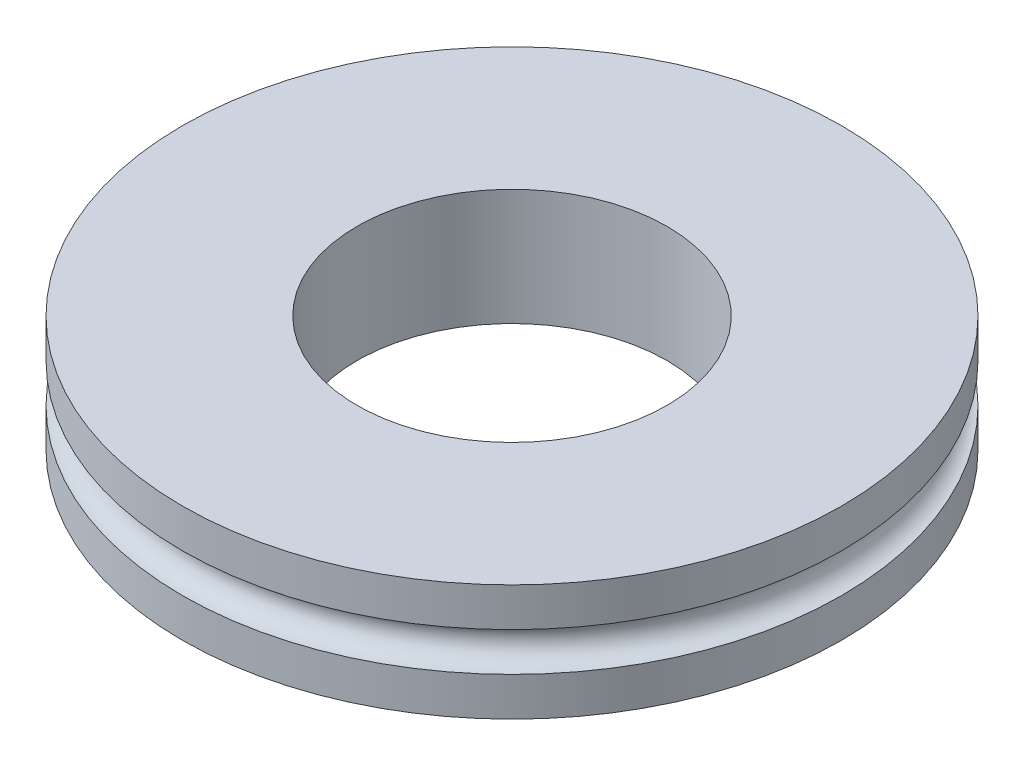
ISO-10303-21;
HEADER;
FILE_DESCRIPTION(('STEP AP214'),'2;1');
FILE_NAME('part.step','',(''),(''),'','','');
FILE_SCHEMA(('AUTOMOTIVE_DESIGN { 1 0 10303 214 1 1 1 1 }'));
ENDSEC;
DATA;
#1=APPLICATION_CONTEXT('core data for automotive mechanical design processes');
#2=APPLICATION_PROTOCOL_DEFINITION('international standard','automotive_design',2000,#1);
#3=PRODUCT_CONTEXT('',#1,'mechanical');
#4=PRODUCT('Part','Part','',(#3));
#5=PRODUCT_RELATED_PRODUCT_CATEGORY('part','',(#4));
#6=PRODUCT_DEFINITION_FORMATION('','',#4);
#7=PRODUCT_DEFINITION_CONTEXT('part definition',#1,'design');
#8=PRODUCT_DEFINITION('design','',#6,#7);
#9=PRODUCT_DEFINITION_SHAPE('','',#8);
#10=(LENGTH_UNIT() NAMED_UNIT(*) SI_UNIT(.MILLI.,.METRE.));
#11=(NAMED_UNIT(*) PLANE_ANGLE_UNIT() SI_UNIT($,.RADIAN.));
#12=(NAMED_UNIT(*) SI_UNIT($,.STERADIAN.) SOLID_ANGLE_UNIT());
#13=UNCERTAINTY_MEASURE_WITH_UNIT(LENGTH_MEASURE(1.E-05),#10,'distance_accuracy_value','');
#14=(GEOMETRIC_REPRESENTATION_CONTEXT(3) GLOBAL_UNCERTAINTY_ASSIGNED_CONTEXT((#13)) GLOBAL_UNIT_ASSIGNED_CONTEXT((#10,
#11,#12)) REPRESENTATION_CONTEXT('',''));
#15=CARTESIAN_POINT('',(0.,0.,0.));
#16=DIRECTION('',(0.,0.,1.));
#17=DIRECTION('',(1.,0.,0.));
#18=AXIS2_PLACEMENT_3D('',#15,#16,#17);
#19=CARTESIAN_POINT('',(0.,-1.5,0.));
#20=DIRECTION('',(0.,-1.,0.));
#21=DIRECTION('',(0.,0.,-1.));
#22=AXIS2_PLACEMENT_3D('',#19,#20,#21);
#23=CYLINDRICAL_SURFACE('',#22,8.5);
#24=CARTESIAN_POINT('',(0.,1.5,0.));
#25=DIRECTION('',(0.,-1.,0.));
#26=DIRECTION('',(0.,0.,-1.));
#27=AXIS2_PLACEMENT_3D('',#24,#25,#26);
#28=CIRCLE('',#27,8.5);
#29=CARTESIAN_POINT('',(0.,1.5,-8.5));
#30=VERTEX_POINT('',#29);
#31=EDGE_CURVE('E10',#30,#30,#28,.T.);
#32=ORIENTED_EDGE('',*,*,#31,.T.);
#33=EDGE_LOOP('',(#32));
#34=FACE_BOUND('',#33,.T.);
#35=CARTESIAN_POINT('',(0.,0.5,0.));
#36=DIRECTION('',(0.,-1.,0.));
#37=DIRECTION('',(0.,0.,-1.));
#38=AXIS2_PLACEMENT_3D('',#35,#36,#37);
#39=CIRCLE('',#38,8.5);
#40=CARTESIAN_POINT('',(0.,0.5,-8.5));
#41=VERTEX_POINT('',#40);
#42=EDGE_CURVE('E70',#41,#41,#39,.T.);
#43=ORIENTED_EDGE('',*,*,#42,.F.);
#44=EDGE_LOOP('',(#43));
#45=FACE_BOUND('',#44,.T.);
#46=ADVANCED_FACE('F43',(#34,#45),#23,.T.);
#47=CARTESIAN_POINT('',(4.,1.5,0.));
#48=DIRECTION('',(0.,1.,0.));
#49=DIRECTION('',(0.,0.,1.));
#50=AXIS2_PLACEMENT_3D('',#47,#48,#49);
#51=PLANE('',#50);
#52=CARTESIAN_POINT('',(0.,1.5,0.));
#53=DIRECTION('',(0.,-1.,0.));
#54=DIRECTION('',(0.,0.,-1.));
#55=AXIS2_PLACEMENT_3D('',#52,#53,#54);
#56=CIRCLE('',#55,4.);
#57=CARTESIAN_POINT('',(0.,1.5,-4.));
#58=VERTEX_POINT('',#57);
#59=EDGE_CURVE('E50',#58,#58,#56,.T.);
#60=ORIENTED_EDGE('',*,*,#59,.T.);
#61=EDGE_LOOP('',(#60));
#62=FACE_BOUND('',#61,.T.);
#63=ORIENTED_EDGE('',*,*,#31,.F.);
#64=EDGE_LOOP('',(#63));
#65=FACE_BOUND('',#64,.T.);
#66=ADVANCED_FACE('F79',(#62,#65),#51,.T.);
#67=CARTESIAN_POINT('',(0.,-1.5,0.));
#68=DIRECTION('',(0.,-1.,0.));
#69=DIRECTION('',(0.,0.,-1.));
#70=AXIS2_PLACEMENT_3D('',#67,#68,#69);
#71=CYLINDRICAL_SURFACE('',#70,4.);
#72=CARTESIAN_POINT('',(0.,-1.5,0.));
#73=DIRECTION('',(0.,-1.,0.));
#74=DIRECTION('',(0.,0.,-1.));
#75=AXIS2_PLACEMENT_3D('',#72,#73,#74);
#76=CIRCLE('',#75,4.);
#77=CARTESIAN_POINT('',(0.,-1.5,-4.));
#78=VERTEX_POINT('',#77);
#79=EDGE_CURVE('E55',#78,#78,#76,.T.);
#80=ORIENTED_EDGE('',*,*,#79,.T.);
#81=EDGE_LOOP('',(#80));
#82=FACE_BOUND('',#81,.T.);
#83=ORIENTED_EDGE('',*,*,#59,.F.);
#84=EDGE_LOOP('',(#83));
#85=FACE_BOUND('',#84,.T.);
#86=ADVANCED_FACE('F83',(#82,#85),#71,.F.);
#87=CARTESIAN_POINT('',(8.5,-1.5,0.));
#88=DIRECTION('',(0.,-1.,0.));
#89=DIRECTION('',(0.,0.,-1.));
#90=AXIS2_PLACEMENT_3D('',#87,#88,#89);
#91=PLANE('',#90);
#92=CARTESIAN_POINT('',(0.,-1.5,0.));
#93=DIRECTION('',(0.,-1.,0.));
#94=DIRECTION('',(0.,0.,-1.));
#95=AXIS2_PLACEMENT_3D('',#92,#93,#94);
#96=CIRCLE('',#95,8.5);
#97=CARTESIAN_POINT('',(0.,-1.5,-8.5));
#98=VERTEX_POINT('',#97);
#99=EDGE_CURVE('E60',#98,#98,#96,.T.);
#100=ORIENTED_EDGE('',*,*,#99,.T.);
#101=EDGE_LOOP('',(#100));
#102=FACE_BOUND('',#101,.T.);
#103=ORIENTED_EDGE('',*,*,#79,.F.);
#104=EDGE_LOOP('',(#103));
#105=FACE_BOUND('',#104,.T.);
#106=ADVANCED_FACE('F87',(#102,#105),#91,.T.);
#107=CARTESIAN_POINT('',(0.,-1.5,0.));
#108=DIRECTION('',(0.,-1.,0.));
#109=DIRECTION('',(0.,0.,-1.));
#110=AXIS2_PLACEMENT_3D('',#107,#108,#109);
#111=CYLINDRICAL_SURFACE('',#110,8.5);
#112=CARTESIAN_POINT('',(0.,-0.5,0.));
#113=DIRECTION('',(0.,-1.,0.));
#114=DIRECTION('',(0.,0.,-1.));
#115=AXIS2_PLACEMENT_3D('',#112,#113,#114);
#116=CIRCLE('',#115,8.5);
#117=CARTESIAN_POINT('',(0.,-0.5,-8.5));
#118=VERTEX_POINT('',#117);
#119=EDGE_CURVE('E66',#118,#118,#116,.T.);
#120=ORIENTED_EDGE('',*,*,#119,.T.);
#121=EDGE_LOOP('',(#120));
#122=FACE_BOUND('',#121,.T.);
#123=ORIENTED_EDGE('',*,*,#99,.F.);
#124=EDGE_LOOP('',(#123));
#125=FACE_BOUND('',#124,.T.);
#126=ADVANCED_FACE('F94',(#122,#125),#111,.T.);
#127=CARTESIAN_POINT('',(0.,0.,0.));
#128=DIRECTION('',(0.,-1.,0.));
#129=DIRECTION('',(0.,0.,-1.));
#130=AXIS2_PLACEMENT_3D('',#127,#128,#129);
#131=TOROIDAL_SURFACE('',#130,8.5,0.5);
#132=ORIENTED_EDGE('',*,*,#42,.T.);
#133=EDGE_LOOP('',(#132));
#134=FACE_BOUND('',#133,.T.);
#135=ORIENTED_EDGE('',*,*,#119,.F.);
#136=EDGE_LOOP('',(#135));
#137=FACE_BOUND('',#136,.T.);
#138=ADVANCED_FACE('F75',(#134,#137),#131,.F.);
#139=CLOSED_SHELL('',(#46,#66,#86,#106,#126,#138));
#140=MANIFOLD_SOLID_BREP('B2',#139);
#141=ADVANCED_BREP_SHAPE_REPRESENTATION('',(#18,#140),#14);
#142=SHAPE_DEFINITION_REPRESENTATION(#9,#141);
ENDSEC;
END-ISO-10303-21;
